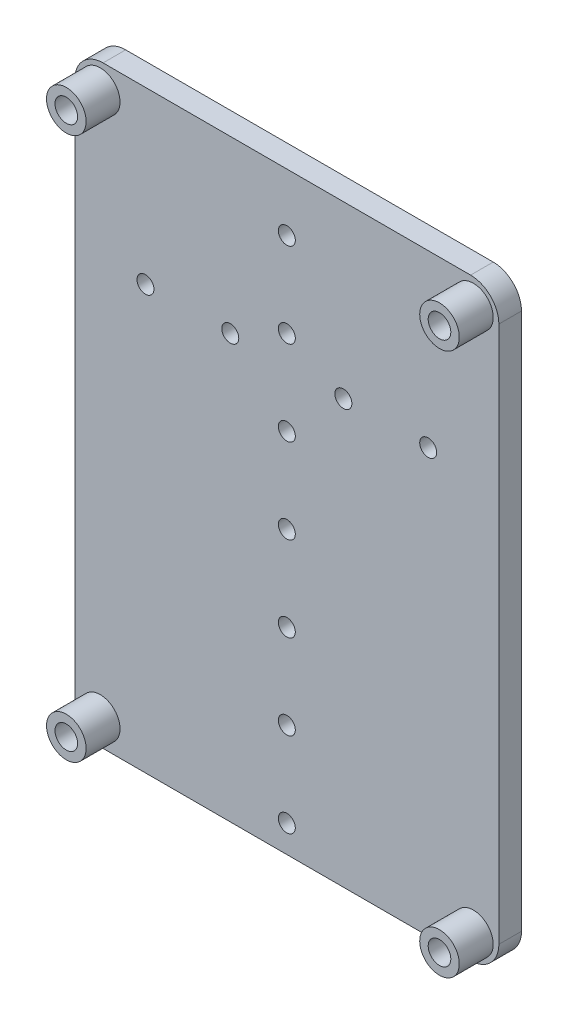
ISO-10303-21;
HEADER;
FILE_DESCRIPTION(('STEP AP214'),'2;1');
FILE_NAME('part.step','',(''),(''),'','','');
FILE_SCHEMA(('AUTOMOTIVE_DESIGN { 1 0 10303 214 1 1 1 1 }'));
ENDSEC;
DATA;
#1=APPLICATION_CONTEXT('core data for automotive mechanical design processes');
#2=APPLICATION_PROTOCOL_DEFINITION('international standard','automotive_design',2000,#1);
#3=PRODUCT_CONTEXT('',#1,'mechanical');
#4=PRODUCT('Part','Part','',(#3));
#5=PRODUCT_RELATED_PRODUCT_CATEGORY('part','',(#4));
#6=PRODUCT_DEFINITION_FORMATION('','',#4);
#7=PRODUCT_DEFINITION_CONTEXT('part definition',#1,'design');
#8=PRODUCT_DEFINITION('design','',#6,#7);
#9=PRODUCT_DEFINITION_SHAPE('','',#8);
#10=(LENGTH_UNIT() NAMED_UNIT(*) SI_UNIT(.MILLI.,.METRE.));
#11=(NAMED_UNIT(*) PLANE_ANGLE_UNIT() SI_UNIT($,.RADIAN.));
#12=(NAMED_UNIT(*) SI_UNIT($,.STERADIAN.) SOLID_ANGLE_UNIT());
#13=UNCERTAINTY_MEASURE_WITH_UNIT(LENGTH_MEASURE(1.E-05),#10,'distance_accuracy_value','');
#14=(GEOMETRIC_REPRESENTATION_CONTEXT(3) GLOBAL_UNCERTAINTY_ASSIGNED_CONTEXT((#13)) GLOBAL_UNIT_ASSIGNED_CONTEXT((#10,
#11,#12)) REPRESENTATION_CONTEXT('',''));
#15=CARTESIAN_POINT('',(0.,0.,0.));
#16=DIRECTION('',(0.,0.,1.));
#17=DIRECTION('',(1.,0.,0.));
#18=AXIS2_PLACEMENT_3D('',#15,#16,#17);
#19=CARTESIAN_POINT('',(101.526557276723,160.311918207768,122.694714262562));
#20=DIRECTION('',(0.,0.,-1.));
#21=DIRECTION('',(-1.,0.,0.));
#22=AXIS2_PLACEMENT_3D('',#19,#20,#21);
#23=CYLINDRICAL_SURFACE('',#22,3.5);
#24=CARTESIAN_POINT('',(101.526557276723,160.311918207768,122.694714262562));
#25=DIRECTION('',(0.,0.,-1.));
#26=DIRECTION('',(-1.,0.,0.));
#27=AXIS2_PLACEMENT_3D('',#24,#25,#26);
#28=CIRCLE('',#27,3.5);
#29=CARTESIAN_POINT('',(98.0265572767228,160.311918207768,122.694714262562));
#30=VERTEX_POINT('',#29);
#31=EDGE_CURVE('E20',#30,#30,#28,.F.);
#32=ORIENTED_EDGE('',*,*,#31,.F.);
#33=EDGE_LOOP('',(#32));
#34=FACE_BOUND('',#33,.T.);
#35=CARTESIAN_POINT('',(101.526557276723,160.311918207768,116.694714262562));
#36=DIRECTION('',(0.,0.,-1.));
#37=DIRECTION('',(-1.,0.,0.));
#38=AXIS2_PLACEMENT_3D('',#35,#36,#37);
#39=CIRCLE('',#38,3.5);
#40=CARTESIAN_POINT('',(98.0265572767228,160.311918207768,116.694714262562));
#41=VERTEX_POINT('',#40);
#42=EDGE_CURVE('E240',#41,#41,#39,.F.);
#43=ORIENTED_EDGE('',*,*,#42,.T.);
#44=EDGE_LOOP('',(#43));
#45=FACE_BOUND('',#44,.T.);
#46=ADVANCED_FACE('F17',(#34,#45),#23,.T.);
#47=CARTESIAN_POINT('',(167.526557276723,64.3119182077676,122.694714262562));
#48=DIRECTION('',(0.,0.,-1.));
#49=DIRECTION('',(-1.,0.,0.));
#50=AXIS2_PLACEMENT_3D('',#47,#48,#49);
#51=CYLINDRICAL_SURFACE('',#50,3.5);
#52=CARTESIAN_POINT('',(167.526557276723,64.3119182077676,122.694714262562));
#53=DIRECTION('',(0.,0.,-1.));
#54=DIRECTION('',(-1.,0.,0.));
#55=AXIS2_PLACEMENT_3D('',#52,#53,#54);
#56=CIRCLE('',#55,3.5);
#57=CARTESIAN_POINT('',(164.026557276723,64.3119182077676,122.694714262562));
#58=VERTEX_POINT('',#57);
#59=EDGE_CURVE('E245',#58,#58,#56,.F.);
#60=ORIENTED_EDGE('',*,*,#59,.F.);
#61=EDGE_LOOP('',(#60));
#62=FACE_BOUND('',#61,.T.);
#63=CARTESIAN_POINT('',(167.526557276723,64.3119182077676,116.694714262562));
#64=DIRECTION('',(0.,0.,-1.));
#65=DIRECTION('',(-1.,0.,0.));
#66=AXIS2_PLACEMENT_3D('',#63,#64,#65);
#67=CIRCLE('',#66,3.5);
#68=CARTESIAN_POINT('',(164.026557276723,64.3119182077676,116.694714262562));
#69=VERTEX_POINT('',#68);
#70=EDGE_CURVE('E234',#69,#69,#67,.F.);
#71=ORIENTED_EDGE('',*,*,#70,.T.);
#72=EDGE_LOOP('',(#71));
#73=FACE_BOUND('',#72,.T.);
#74=ADVANCED_FACE('F256',(#62,#73),#51,.T.);
#75=CARTESIAN_POINT('',(101.526557276723,64.3119182077676,122.694714262562));
#76=DIRECTION('',(0.,0.,-1.));
#77=DIRECTION('',(-1.,0.,0.));
#78=AXIS2_PLACEMENT_3D('',#75,#76,#77);
#79=CYLINDRICAL_SURFACE('',#78,3.5);
#80=CARTESIAN_POINT('',(101.526557276723,64.3119182077676,116.694714262562));
#81=DIRECTION('',(0.,0.,-1.));
#82=DIRECTION('',(-1.,0.,0.));
#83=AXIS2_PLACEMENT_3D('',#80,#81,#82);
#84=CIRCLE('',#83,3.5);
#85=CARTESIAN_POINT('',(98.0265572767228,64.3119182077676,116.694714262562));
#86=VERTEX_POINT('',#85);
#87=EDGE_CURVE('E243',#86,#86,#84,.F.);
#88=ORIENTED_EDGE('',*,*,#87,.T.);
#89=EDGE_LOOP('',(#88));
#90=FACE_BOUND('',#89,.T.);
#91=CARTESIAN_POINT('',(101.526557276723,64.3119182077676,122.694714262562));
#92=DIRECTION('',(0.,0.,-1.));
#93=DIRECTION('',(-1.,0.,0.));
#94=AXIS2_PLACEMENT_3D('',#91,#92,#93);
#95=CIRCLE('',#94,3.5);
#96=CARTESIAN_POINT('',(98.0265572767228,64.3119182077676,122.694714262562));
#97=VERTEX_POINT('',#96);
#98=EDGE_CURVE('E231',#97,#97,#95,.F.);
#99=ORIENTED_EDGE('',*,*,#98,.F.);
#100=EDGE_LOOP('',(#99));
#101=FACE_BOUND('',#100,.T.);
#102=ADVANCED_FACE('F266',(#90,#101),#79,.T.);
#103=CARTESIAN_POINT('',(167.526557276723,160.311918207768,122.694714262562));
#104=DIRECTION('',(0.,0.,-1.));
#105=DIRECTION('',(-1.,0.,0.));
#106=AXIS2_PLACEMENT_3D('',#103,#104,#105);
#107=CYLINDRICAL_SURFACE('',#106,3.5);
#108=CARTESIAN_POINT('',(167.526557276723,160.311918207768,116.694714262562));
#109=DIRECTION('',(0.,0.,-1.));
#110=DIRECTION('',(-1.,0.,0.));
#111=AXIS2_PLACEMENT_3D('',#108,#109,#110);
#112=CIRCLE('',#111,3.5);
#113=CARTESIAN_POINT('',(164.026557276723,160.311918207768,116.694714262562));
#114=VERTEX_POINT('',#113);
#115=EDGE_CURVE('E237',#114,#114,#112,.F.);
#116=ORIENTED_EDGE('',*,*,#115,.T.);
#117=EDGE_LOOP('',(#116));
#118=FACE_BOUND('',#117,.T.);
#119=CARTESIAN_POINT('',(167.526557276723,160.311918207768,122.694714262562));
#120=DIRECTION('',(0.,0.,-1.));
#121=DIRECTION('',(-1.,0.,0.));
#122=AXIS2_PLACEMENT_3D('',#119,#120,#121);
#123=CIRCLE('',#122,3.5);
#124=CARTESIAN_POINT('',(164.026557276723,160.311918207768,122.694714262562));
#125=VERTEX_POINT('',#124);
#126=EDGE_CURVE('E228',#125,#125,#123,.F.);
#127=ORIENTED_EDGE('',*,*,#126,.F.);
#128=EDGE_LOOP('',(#127));
#129=FACE_BOUND('',#128,.T.);
#130=ADVANCED_FACE('F269',(#118,#129),#107,.T.);
#131=CARTESIAN_POINT('',(101.526557276723,160.311918207768,122.694714262562));
#132=DIRECTION('',(0.,0.,1.));
#133=DIRECTION('',(1.,0.,0.));
#134=AXIS2_PLACEMENT_3D('',#131,#132,#133);
#135=PLANE('',#134);
#136=CARTESIAN_POINT('',(101.526557276723,160.311918207768,122.694714262562));
#137=DIRECTION('',(0.,0.,1.));
#138=DIRECTION('',(1.,0.,0.));
#139=AXIS2_PLACEMENT_3D('',#136,#137,#138);
#140=CIRCLE('',#139,2.);
#141=CARTESIAN_POINT('',(103.526557276723,160.311918207768,122.694714262562));
#142=VERTEX_POINT('',#141);
#143=EDGE_CURVE('E225',#142,#142,#140,.F.);
#144=ORIENTED_EDGE('',*,*,#143,.T.);
#145=EDGE_LOOP('',(#144));
#146=FACE_BOUND('',#145,.T.);
#147=ORIENTED_EDGE('',*,*,#31,.T.);
#148=EDGE_LOOP('',(#147));
#149=FACE_BOUND('',#148,.T.);
#150=ADVANCED_FACE('F252',(#146,#149),#135,.T.);
#151=CARTESIAN_POINT('',(167.526557276723,64.3119182077676,122.694714262562));
#152=DIRECTION('',(0.,0.,1.));
#153=DIRECTION('',(1.,0.,0.));
#154=AXIS2_PLACEMENT_3D('',#151,#152,#153);
#155=PLANE('',#154);
#156=CARTESIAN_POINT('',(167.526557276723,64.3119182077676,122.694714262562));
#157=DIRECTION('',(0.,0.,1.));
#158=DIRECTION('',(1.,0.,0.));
#159=AXIS2_PLACEMENT_3D('',#156,#157,#158);
#160=CIRCLE('',#159,2.);
#161=CARTESIAN_POINT('',(169.526557276723,64.3119182077676,122.694714262562));
#162=VERTEX_POINT('',#161);
#163=EDGE_CURVE('E222',#162,#162,#160,.F.);
#164=ORIENTED_EDGE('',*,*,#163,.T.);
#165=EDGE_LOOP('',(#164));
#166=FACE_BOUND('',#165,.T.);
#167=ORIENTED_EDGE('',*,*,#59,.T.);
#168=EDGE_LOOP('',(#167));
#169=FACE_BOUND('',#168,.T.);
#170=ADVANCED_FACE('F261',(#166,#169),#155,.T.);
#171=CARTESIAN_POINT('',(0.,0.,116.694714262562));
#172=DIRECTION('',(0.,0.,-1.));
#173=DIRECTION('',(-1.,0.,0.));
#174=AXIS2_PLACEMENT_3D('',#171,#172,#173);
#175=PLANE('',#174);
#176=ORIENTED_EDGE('',*,*,#70,.F.);
#177=EDGE_LOOP('',(#176));
#178=FACE_BOUND('',#177,.T.);
#179=ORIENTED_EDGE('',*,*,#115,.F.);
#180=EDGE_LOOP('',(#179));
#181=FACE_BOUND('',#180,.T.);
#182=CARTESIAN_POINT('',(134.526557276723,64.6370852747385,116.694714262562));
#183=DIRECTION('',(0.,0.,1.));
#184=DIRECTION('',(1.,0.,0.));
#185=AXIS2_PLACEMENT_3D('',#182,#183,#184);
#186=CIRCLE('',#185,1.5);
#187=CARTESIAN_POINT('',(136.026557276723,64.6370852747385,116.694714262562));
#188=VERTEX_POINT('',#187);
#189=EDGE_CURVE('E183',#188,#188,#186,.F.);
#190=ORIENTED_EDGE('',*,*,#189,.T.);
#191=EDGE_LOOP('',(#190));
#192=FACE_BOUND('',#191,.T.);
#193=CARTESIAN_POINT('',(134.526557276723,79.6370852747385,116.694714262562));
#194=DIRECTION('',(0.,0.,1.));
#195=DIRECTION('',(1.,0.,0.));
#196=AXIS2_PLACEMENT_3D('',#193,#194,#195);
#197=CIRCLE('',#196,1.5);
#198=CARTESIAN_POINT('',(136.026557276723,79.6370852747385,116.694714262562));
#199=VERTEX_POINT('',#198);
#200=EDGE_CURVE('E219',#199,#199,#197,.F.);
#201=ORIENTED_EDGE('',*,*,#200,.T.);
#202=EDGE_LOOP('',(#201));
#203=FACE_BOUND('',#202,.T.);
#204=CARTESIAN_POINT('',(134.526557276723,94.6370852747384,116.694714262562));
#205=DIRECTION('',(0.,0.,1.));
#206=DIRECTION('',(1.,0.,0.));
#207=AXIS2_PLACEMENT_3D('',#204,#205,#206);
#208=CIRCLE('',#207,1.5);
#209=CARTESIAN_POINT('',(136.026557276723,94.6370852747384,116.694714262562));
#210=VERTEX_POINT('',#209);
#211=EDGE_CURVE('E186',#210,#210,#208,.F.);
#212=ORIENTED_EDGE('',*,*,#211,.T.);
#213=EDGE_LOOP('',(#212));
#214=FACE_BOUND('',#213,.T.);
#215=CARTESIAN_POINT('',(134.526557276723,109.637085274738,116.694714262562));
#216=DIRECTION('',(0.,0.,1.));
#217=DIRECTION('',(1.,0.,0.));
#218=AXIS2_PLACEMENT_3D('',#215,#216,#217);
#219=CIRCLE('',#218,1.5);
#220=CARTESIAN_POINT('',(136.026557276723,109.637085274738,116.694714262562));
#221=VERTEX_POINT('',#220);
#222=EDGE_CURVE('E216',#221,#221,#219,.F.);
#223=ORIENTED_EDGE('',*,*,#222,.T.);
#224=EDGE_LOOP('',(#223));
#225=FACE_BOUND('',#224,.T.);
#226=CARTESIAN_POINT('',(134.526557276723,124.637085274738,116.694714262562));
#227=DIRECTION('',(0.,0.,1.));
#228=DIRECTION('',(1.,0.,0.));
#229=AXIS2_PLACEMENT_3D('',#226,#227,#228);
#230=CIRCLE('',#229,1.5);
#231=CARTESIAN_POINT('',(136.026557276723,124.637085274738,116.694714262562));
#232=VERTEX_POINT('',#231);
#233=EDGE_CURVE('E189',#232,#232,#230,.F.);
#234=ORIENTED_EDGE('',*,*,#233,.T.);
#235=EDGE_LOOP('',(#234));
#236=FACE_BOUND('',#235,.T.);
#237=CARTESIAN_POINT('',(109.526557276723,134.637085274738,116.694714262562));
#238=DIRECTION('',(0.,0.,1.));
#239=DIRECTION('',(1.,0.,0.));
#240=AXIS2_PLACEMENT_3D('',#237,#238,#239);
#241=CIRCLE('',#240,1.5);
#242=CARTESIAN_POINT('',(111.026557276723,134.637085274738,116.694714262562));
#243=VERTEX_POINT('',#242);
#244=EDGE_CURVE('E213',#243,#243,#241,.F.);
#245=ORIENTED_EDGE('',*,*,#244,.T.);
#246=EDGE_LOOP('',(#245));
#247=FACE_BOUND('',#246,.T.);
#248=CARTESIAN_POINT('',(124.526557276723,134.637085274738,116.694714262562));
#249=DIRECTION('',(0.,0.,1.));
#250=DIRECTION('',(1.,0.,0.));
#251=AXIS2_PLACEMENT_3D('',#248,#249,#250);
#252=CIRCLE('',#251,1.50000000000002);
#253=CARTESIAN_POINT('',(126.026557276723,134.637085274738,116.694714262562));
#254=VERTEX_POINT('',#253);
#255=EDGE_CURVE('E192',#254,#254,#252,.F.);
#256=ORIENTED_EDGE('',*,*,#255,.T.);
#257=EDGE_LOOP('',(#256));
#258=FACE_BOUND('',#257,.T.);
#259=CARTESIAN_POINT('',(159.526557276723,134.637085274738,116.694714262562));
#260=DIRECTION('',(0.,0.,1.));
#261=DIRECTION('',(1.,0.,0.));
#262=AXIS2_PLACEMENT_3D('',#259,#260,#261);
#263=CIRCLE('',#262,1.5);
#264=CARTESIAN_POINT('',(161.026557276723,134.637085274738,116.694714262562));
#265=VERTEX_POINT('',#264);
#266=EDGE_CURVE('E210',#265,#265,#263,.F.);
#267=ORIENTED_EDGE('',*,*,#266,.T.);
#268=EDGE_LOOP('',(#267));
#269=FACE_BOUND('',#268,.T.);
#270=CARTESIAN_POINT('',(144.526557276723,134.637085274738,116.694714262562));
#271=DIRECTION('',(0.,0.,1.));
#272=DIRECTION('',(1.,0.,0.));
#273=AXIS2_PLACEMENT_3D('',#270,#271,#272);
#274=CIRCLE('',#273,1.50000000000003);
#275=CARTESIAN_POINT('',(146.026557276723,134.637085274738,116.694714262562));
#276=VERTEX_POINT('',#275);
#277=EDGE_CURVE('E195',#276,#276,#274,.F.);
#278=ORIENTED_EDGE('',*,*,#277,.T.);
#279=EDGE_LOOP('',(#278));
#280=FACE_BOUND('',#279,.T.);
#281=CARTESIAN_POINT('',(134.526557276723,139.637085274738,116.694714262562));
#282=DIRECTION('',(0.,0.,1.));
#283=DIRECTION('',(1.,0.,0.));
#284=AXIS2_PLACEMENT_3D('',#281,#282,#283);
#285=CIRCLE('',#284,1.5);
#286=CARTESIAN_POINT('',(136.026557276723,139.637085274738,116.694714262562));
#287=VERTEX_POINT('',#286);
#288=EDGE_CURVE('E113',#287,#287,#285,.F.);
#289=ORIENTED_EDGE('',*,*,#288,.T.);
#290=EDGE_LOOP('',(#289));
#291=FACE_BOUND('',#290,.T.);
#292=CARTESIAN_POINT('',(134.526557276723,154.637085274738,116.694714262562));
#293=DIRECTION('',(0.,0.,1.));
#294=DIRECTION('',(1.,0.,0.));
#295=AXIS2_PLACEMENT_3D('',#292,#293,#294);
#296=CIRCLE('',#295,1.5);
#297=CARTESIAN_POINT('',(136.026557276723,154.637085274738,116.694714262562));
#298=VERTEX_POINT('',#297);
#299=EDGE_CURVE('E198',#298,#298,#296,.F.);
#300=ORIENTED_EDGE('',*,*,#299,.T.);
#301=EDGE_LOOP('',(#300));
#302=FACE_BOUND('',#301,.T.);
#303=CARTESIAN_POINT('',(102.026557276723,64.8119182077676,116.694714262562));
#304=DIRECTION('',(0.,0.,1.));
#305=DIRECTION('',(1.,0.,0.));
#306=AXIS2_PLACEMENT_3D('',#303,#304,#305);
#307=CIRCLE('',#306,5.);
#308=CARTESIAN_POINT('',(102.026557276723,59.8119182077676,116.694714262562));
#309=VERTEX_POINT('',#308);
#310=CARTESIAN_POINT('',(97.0265572767228,64.8119182077676,116.694714262562));
#311=VERTEX_POINT('',#310);
#312=EDGE_CURVE('E87',#309,#311,#307,.F.);
#313=ORIENTED_EDGE('',*,*,#312,.F.);
#314=DIRECTION('',(1.,0.,0.));
#315=VECTOR('',#314,1.);
#316=CARTESIAN_POINT('',(172.026557276723,59.8119182077676,116.694714262562));
#317=LINE('',#316,#315);
#318=CARTESIAN_POINT('',(167.026557276723,59.8119182077676,116.694714262562));
#319=VERTEX_POINT('',#318);
#320=EDGE_CURVE('E78',#309,#319,#317,.T.);
#321=ORIENTED_EDGE('',*,*,#320,.T.);
#322=CARTESIAN_POINT('',(167.026557276723,64.8119182077676,116.694714262562));
#323=DIRECTION('',(0.,0.,1.));
#324=DIRECTION('',(1.,0.,0.));
#325=AXIS2_PLACEMENT_3D('',#322,#323,#324);
#326=CIRCLE('',#325,5.);
#327=CARTESIAN_POINT('',(172.026557276723,64.8119182077676,116.694714262562));
#328=VERTEX_POINT('',#327);
#329=EDGE_CURVE('E202',#328,#319,#326,.F.);
#330=ORIENTED_EDGE('',*,*,#329,.F.);
#331=DIRECTION('',(0.,1.,0.));
#332=VECTOR('',#331,1.);
#333=CARTESIAN_POINT('',(172.026557276723,164.811918207768,116.694714262562));
#334=LINE('',#333,#332);
#335=CARTESIAN_POINT('',(172.026557276723,159.811918207768,116.694714262562));
#336=VERTEX_POINT('',#335);
#337=EDGE_CURVE('E114',#328,#336,#334,.T.);
#338=ORIENTED_EDGE('',*,*,#337,.T.);
#339=CARTESIAN_POINT('',(167.026557276723,159.811918207768,116.694714262562));
#340=DIRECTION('',(0.,0.,1.));
#341=DIRECTION('',(1.,0.,0.));
#342=AXIS2_PLACEMENT_3D('',#339,#340,#341);
#343=CIRCLE('',#342,5.);
#344=CARTESIAN_POINT('',(167.026557276723,164.811918207768,116.694714262562));
#345=VERTEX_POINT('',#344);
#346=EDGE_CURVE('E205',#345,#336,#343,.F.);
#347=ORIENTED_EDGE('',*,*,#346,.F.);
#348=DIRECTION('',(1.,0.,0.));
#349=VECTOR('',#348,1.);
#350=CARTESIAN_POINT('',(172.026557276723,164.811918207768,116.694714262562));
#351=LINE('',#350,#349);
#352=CARTESIAN_POINT('',(102.026557276723,164.811918207768,116.694714262562));
#353=VERTEX_POINT('',#352);
#354=EDGE_CURVE('E118',#345,#353,#351,.F.);
#355=ORIENTED_EDGE('',*,*,#354,.T.);
#356=CARTESIAN_POINT('',(102.026557276723,159.811918207768,116.694714262562));
#357=DIRECTION('',(0.,0.,1.));
#358=DIRECTION('',(1.,0.,0.));
#359=AXIS2_PLACEMENT_3D('',#356,#357,#358);
#360=CIRCLE('',#359,5.);
#361=CARTESIAN_POINT('',(97.0265572767228,159.811918207768,116.694714262562));
#362=VERTEX_POINT('',#361);
#363=EDGE_CURVE('E90',#362,#353,#360,.F.);
#364=ORIENTED_EDGE('',*,*,#363,.F.);
#365=DIRECTION('',(0.,1.,0.));
#366=VECTOR('',#365,1.);
#367=CARTESIAN_POINT('',(97.0265572767228,164.811918207768,116.694714262562));
#368=LINE('',#367,#366);
#369=EDGE_CURVE('E83',#362,#311,#368,.F.);
#370=ORIENTED_EDGE('',*,*,#369,.T.);
#371=EDGE_LOOP('',(#313,#321,#330,#338,#347,#355,#364,#370));
#372=FACE_BOUND('',#371,.T.);
#373=ORIENTED_EDGE('',*,*,#42,.F.);
#374=EDGE_LOOP('',(#373));
#375=FACE_BOUND('',#374,.T.);
#376=ORIENTED_EDGE('',*,*,#87,.F.);
#377=EDGE_LOOP('',(#376));
#378=FACE_BOUND('',#377,.T.);
#379=ADVANCED_FACE('F85',(#178,#181,#192,#203,#214,#225,#236,#247,#258,#269,#280,#291,#302,#372,
#375,#378),#175,.F.);
#380=CARTESIAN_POINT('',(101.526557276723,64.3119182077676,122.694714262562));
#381=DIRECTION('',(0.,0.,1.));
#382=DIRECTION('',(1.,0.,0.));
#383=AXIS2_PLACEMENT_3D('',#380,#381,#382);
#384=PLANE('',#383);
#385=CARTESIAN_POINT('',(101.526557276723,64.3119182077676,122.694714262562));
#386=DIRECTION('',(0.,0.,1.));
#387=DIRECTION('',(1.,0.,0.));
#388=AXIS2_PLACEMENT_3D('',#385,#386,#387);
#389=CIRCLE('',#388,2.);
#390=CARTESIAN_POINT('',(103.526557276723,64.3119182077676,122.694714262562));
#391=VERTEX_POINT('',#390);
#392=EDGE_CURVE('E180',#391,#391,#389,.F.);
#393=ORIENTED_EDGE('',*,*,#392,.T.);
#394=EDGE_LOOP('',(#393));
#395=FACE_BOUND('',#394,.T.);
#396=ORIENTED_EDGE('',*,*,#98,.T.);
#397=EDGE_LOOP('',(#396));
#398=FACE_BOUND('',#397,.T.);
#399=ADVANCED_FACE('F260',(#395,#398),#384,.T.);
#400=CARTESIAN_POINT('',(167.526557276723,160.311918207768,122.694714262562));
#401=DIRECTION('',(0.,0.,1.));
#402=DIRECTION('',(1.,0.,0.));
#403=AXIS2_PLACEMENT_3D('',#400,#401,#402);
#404=PLANE('',#403);
#405=CARTESIAN_POINT('',(167.526557276723,160.311918207768,122.694714262562));
#406=DIRECTION('',(0.,0.,1.));
#407=DIRECTION('',(1.,0.,0.));
#408=AXIS2_PLACEMENT_3D('',#405,#406,#407);
#409=CIRCLE('',#408,2.);
#410=CARTESIAN_POINT('',(169.526557276723,160.311918207768,122.694714262562));
#411=VERTEX_POINT('',#410);
#412=EDGE_CURVE('E177',#411,#411,#409,.F.);
#413=ORIENTED_EDGE('',*,*,#412,.T.);
#414=EDGE_LOOP('',(#413));
#415=FACE_BOUND('',#414,.T.);
#416=ORIENTED_EDGE('',*,*,#126,.T.);
#417=EDGE_LOOP('',(#416));
#418=FACE_BOUND('',#417,.T.);
#419=ADVANCED_FACE('F274',(#415,#418),#404,.T.);
#420=CARTESIAN_POINT('',(101.526557276723,160.311918207768,112.694714262562));
#421=DIRECTION('',(0.,0.,1.));
#422=DIRECTION('',(1.,0.,0.));
#423=AXIS2_PLACEMENT_3D('',#420,#421,#422);
#424=CYLINDRICAL_SURFACE('',#423,2.);
#425=CARTESIAN_POINT('',(101.526557276723,160.311918207768,112.694714262562));
#426=DIRECTION('',(0.,0.,1.));
#427=DIRECTION('',(1.,0.,0.));
#428=AXIS2_PLACEMENT_3D('',#425,#426,#427);
#429=CIRCLE('',#428,2.);
#430=CARTESIAN_POINT('',(103.526557276723,160.311918207768,112.694714262562));
#431=VERTEX_POINT('',#430);
#432=EDGE_CURVE('E174',#431,#431,#429,.T.);
#433=ORIENTED_EDGE('',*,*,#432,.F.);
#434=EDGE_LOOP('',(#433));
#435=FACE_BOUND('',#434,.T.);
#436=ORIENTED_EDGE('',*,*,#143,.F.);
#437=EDGE_LOOP('',(#436));
#438=FACE_BOUND('',#437,.T.);
#439=ADVANCED_FACE('F281',(#435,#438),#424,.F.);
#440=CARTESIAN_POINT('',(167.526557276723,64.3119182077676,112.694714262562));
#441=DIRECTION('',(0.,0.,1.));
#442=DIRECTION('',(1.,0.,0.));
#443=AXIS2_PLACEMENT_3D('',#440,#441,#442);
#444=CYLINDRICAL_SURFACE('',#443,2.);
#445=CARTESIAN_POINT('',(167.526557276723,64.3119182077676,112.694714262562));
#446=DIRECTION('',(0.,0.,1.));
#447=DIRECTION('',(1.,0.,0.));
#448=AXIS2_PLACEMENT_3D('',#445,#446,#447);
#449=CIRCLE('',#448,2.);
#450=CARTESIAN_POINT('',(169.526557276723,64.3119182077676,112.694714262562));
#451=VERTEX_POINT('',#450);
#452=EDGE_CURVE('E171',#451,#451,#449,.T.);
#453=ORIENTED_EDGE('',*,*,#452,.F.);
#454=EDGE_LOOP('',(#453));
#455=FACE_BOUND('',#454,.T.);
#456=ORIENTED_EDGE('',*,*,#163,.F.);
#457=EDGE_LOOP('',(#456));
#458=FACE_BOUND('',#457,.T.);
#459=ADVANCED_FACE('F369',(#455,#458),#444,.F.);
#460=CARTESIAN_POINT('',(134.526557276723,79.6370852747385,112.694714262562));
#461=DIRECTION('',(0.,0.,1.));
#462=DIRECTION('',(1.,0.,0.));
#463=AXIS2_PLACEMENT_3D('',#460,#461,#462);
#464=CYLINDRICAL_SURFACE('',#463,1.5);
#465=CARTESIAN_POINT('',(134.526557276723,79.6370852747385,112.694714262562));
#466=DIRECTION('',(0.,0.,1.));
#467=DIRECTION('',(1.,0.,0.));
#468=AXIS2_PLACEMENT_3D('',#465,#466,#467);
#469=CIRCLE('',#468,1.5);
#470=CARTESIAN_POINT('',(136.026557276723,79.6370852747385,112.694714262562));
#471=VERTEX_POINT('',#470);
#472=EDGE_CURVE('E168',#471,#471,#469,.T.);
#473=ORIENTED_EDGE('',*,*,#472,.F.);
#474=EDGE_LOOP('',(#473));
#475=FACE_BOUND('',#474,.T.);
#476=ORIENTED_EDGE('',*,*,#200,.F.);
#477=EDGE_LOOP('',(#476));
#478=FACE_BOUND('',#477,.T.);
#479=ADVANCED_FACE('F365',(#475,#478),#464,.F.);
#480=CARTESIAN_POINT('',(134.526557276723,109.637085274738,112.694714262562));
#481=DIRECTION('',(0.,0.,1.));
#482=DIRECTION('',(1.,0.,0.));
#483=AXIS2_PLACEMENT_3D('',#480,#481,#482);
#484=CYLINDRICAL_SURFACE('',#483,1.5);
#485=CARTESIAN_POINT('',(134.526557276723,109.637085274738,112.694714262562));
#486=DIRECTION('',(0.,0.,1.));
#487=DIRECTION('',(1.,0.,0.));
#488=AXIS2_PLACEMENT_3D('',#485,#486,#487);
#489=CIRCLE('',#488,1.5);
#490=CARTESIAN_POINT('',(136.026557276723,109.637085274738,112.694714262562));
#491=VERTEX_POINT('',#490);
#492=EDGE_CURVE('E165',#491,#491,#489,.T.);
#493=ORIENTED_EDGE('',*,*,#492,.F.);
#494=EDGE_LOOP('',(#493));
#495=FACE_BOUND('',#494,.T.);
#496=ORIENTED_EDGE('',*,*,#222,.F.);
#497=EDGE_LOOP('',(#496));
#498=FACE_BOUND('',#497,.T.);
#499=ADVANCED_FACE('F361',(#495,#498),#484,.F.);
#500=CARTESIAN_POINT('',(109.526557276723,134.637085274738,112.694714262562));
#501=DIRECTION('',(0.,0.,1.));
#502=DIRECTION('',(1.,0.,0.));
#503=AXIS2_PLACEMENT_3D('',#500,#501,#502);
#504=CYLINDRICAL_SURFACE('',#503,1.5);
#505=CARTESIAN_POINT('',(109.526557276723,134.637085274738,112.694714262562));
#506=DIRECTION('',(0.,0.,1.));
#507=DIRECTION('',(1.,0.,0.));
#508=AXIS2_PLACEMENT_3D('',#505,#506,#507);
#509=CIRCLE('',#508,1.5);
#510=CARTESIAN_POINT('',(111.026557276723,134.637085274738,112.694714262562));
#511=VERTEX_POINT('',#510);
#512=EDGE_CURVE('E162',#511,#511,#509,.T.);
#513=ORIENTED_EDGE('',*,*,#512,.F.);
#514=EDGE_LOOP('',(#513));
#515=FACE_BOUND('',#514,.T.);
#516=ORIENTED_EDGE('',*,*,#244,.F.);
#517=EDGE_LOOP('',(#516));
#518=FACE_BOUND('',#517,.T.);
#519=ADVANCED_FACE('F357',(#515,#518),#504,.F.);
#520=CARTESIAN_POINT('',(159.526557276723,134.637085274738,112.694714262562));
#521=DIRECTION('',(0.,0.,1.));
#522=DIRECTION('',(1.,0.,0.));
#523=AXIS2_PLACEMENT_3D('',#520,#521,#522);
#524=CYLINDRICAL_SURFACE('',#523,1.5);
#525=CARTESIAN_POINT('',(159.526557276723,134.637085274738,112.694714262562));
#526=DIRECTION('',(0.,0.,1.));
#527=DIRECTION('',(1.,0.,0.));
#528=AXIS2_PLACEMENT_3D('',#525,#526,#527);
#529=CIRCLE('',#528,1.5);
#530=CARTESIAN_POINT('',(161.026557276723,134.637085274738,112.694714262562));
#531=VERTEX_POINT('',#530);
#532=EDGE_CURVE('E159',#531,#531,#529,.T.);
#533=ORIENTED_EDGE('',*,*,#532,.F.);
#534=EDGE_LOOP('',(#533));
#535=FACE_BOUND('',#534,.T.);
#536=ORIENTED_EDGE('',*,*,#266,.F.);
#537=EDGE_LOOP('',(#536));
#538=FACE_BOUND('',#537,.T.);
#539=ADVANCED_FACE('F353',(#535,#538),#524,.F.);
#540=CARTESIAN_POINT('',(134.526557276723,139.637085274738,112.694714262562));
#541=DIRECTION('',(0.,0.,1.));
#542=DIRECTION('',(1.,0.,0.));
#543=AXIS2_PLACEMENT_3D('',#540,#541,#542);
#544=CYLINDRICAL_SURFACE('',#543,1.5);
#545=CARTESIAN_POINT('',(134.526557276723,139.637085274738,112.694714262562));
#546=DIRECTION('',(0.,0.,1.));
#547=DIRECTION('',(1.,0.,0.));
#548=AXIS2_PLACEMENT_3D('',#545,#546,#547);
#549=CIRCLE('',#548,1.5);
#550=CARTESIAN_POINT('',(136.026557276723,139.637085274738,112.694714262562));
#551=VERTEX_POINT('',#550);
#552=EDGE_CURVE('E156',#551,#551,#549,.T.);
#553=ORIENTED_EDGE('',*,*,#552,.F.);
#554=EDGE_LOOP('',(#553));
#555=FACE_BOUND('',#554,.T.);
#556=ORIENTED_EDGE('',*,*,#288,.F.);
#557=EDGE_LOOP('',(#556));
#558=FACE_BOUND('',#557,.T.);
#559=ADVANCED_FACE('F350',(#555,#558),#544,.F.);
#560=CARTESIAN_POINT('',(172.026557276723,59.8119182077676,112.694714262562));
#561=DIRECTION('',(0.,1.,0.));
#562=DIRECTION('',(0.,0.,1.));
#563=AXIS2_PLACEMENT_3D('',#560,#561,#562);
#564=PLANE('',#563);
#565=DIRECTION('',(0.,0.,1.));
#566=VECTOR('',#565,1.);
#567=CARTESIAN_POINT('',(102.026557276723,59.8119182077676,112.694714262562));
#568=LINE('',#567,#566);
#569=CARTESIAN_POINT('',(102.026557276723,59.8119182077676,112.694714262562));
#570=VERTEX_POINT('',#569);
#571=EDGE_CURVE('E100',#570,#309,#568,.T.);
#572=ORIENTED_EDGE('',*,*,#571,.F.);
#573=DIRECTION('',(-1.,0.,0.));
#574=VECTOR('',#573,1.);
#575=CARTESIAN_POINT('',(0.,59.8119182077676,112.694714262562));
#576=LINE('',#575,#574);
#577=CARTESIAN_POINT('',(167.026557276723,59.8119182077676,112.694714262562));
#578=VERTEX_POINT('',#577);
#579=EDGE_CURVE('E155',#578,#570,#576,.T.);
#580=ORIENTED_EDGE('',*,*,#579,.F.);
#581=DIRECTION('',(0.,0.,1.));
#582=VECTOR('',#581,1.);
#583=CARTESIAN_POINT('',(167.026557276723,59.8119182077676,112.694714262562));
#584=LINE('',#583,#582);
#585=EDGE_CURVE('E201',#319,#578,#584,.F.);
#586=ORIENTED_EDGE('',*,*,#585,.F.);
#587=ORIENTED_EDGE('',*,*,#320,.F.);
#588=EDGE_LOOP('',(#572,#580,#586,#587));
#589=FACE_BOUND('',#588,.T.);
#590=ADVANCED_FACE('F347',(#589),#564,.F.);
#591=CARTESIAN_POINT('',(102.026557276723,64.8119182077676,112.694714262562));
#592=DIRECTION('',(0.,0.,1.));
#593=DIRECTION('',(1.,0.,0.));
#594=AXIS2_PLACEMENT_3D('',#591,#592,#593);
#595=CYLINDRICAL_SURFACE('',#594,5.);
#596=ORIENTED_EDGE('',*,*,#312,.T.);
#597=DIRECTION('',(0.,0.,-1.));
#598=VECTOR('',#597,1.);
#599=CARTESIAN_POINT('',(97.0265572767228,64.8119182077676,112.694714262562));
#600=LINE('',#599,#598);
#601=CARTESIAN_POINT('',(97.0265572767228,64.8119182077676,112.694714262562));
#602=VERTEX_POINT('',#601);
#603=EDGE_CURVE('E94',#311,#602,#600,.T.);
#604=ORIENTED_EDGE('',*,*,#603,.T.);
#605=CARTESIAN_POINT('',(102.026557276723,64.8119182077676,112.694714262562));
#606=DIRECTION('',(0.,0.,1.));
#607=DIRECTION('',(1.,0.,0.));
#608=AXIS2_PLACEMENT_3D('',#605,#606,#607);
#609=CIRCLE('',#608,5.);
#610=EDGE_CURVE('E153',#570,#602,#609,.F.);
#611=ORIENTED_EDGE('',*,*,#610,.F.);
#612=ORIENTED_EDGE('',*,*,#571,.T.);
#613=EDGE_LOOP('',(#596,#604,#611,#612));
#614=FACE_BOUND('',#613,.T.);
#615=ADVANCED_FACE('F97',(#614),#595,.T.);
#616=CARTESIAN_POINT('',(97.0265572767228,164.811918207768,112.694714262562));
#617=DIRECTION('',(1.,0.,0.));
#618=DIRECTION('',(0.,0.,-1.));
#619=AXIS2_PLACEMENT_3D('',#616,#617,#618);
#620=PLANE('',#619);
#621=ORIENTED_EDGE('',*,*,#603,.F.);
#622=ORIENTED_EDGE('',*,*,#369,.F.);
#623=DIRECTION('',(0.,0.,1.));
#624=VECTOR('',#623,1.);
#625=CARTESIAN_POINT('',(97.0265572767228,159.811918207768,112.694714262562));
#626=LINE('',#625,#624);
#627=CARTESIAN_POINT('',(97.0265572767228,159.811918207768,112.694714262562));
#628=VERTEX_POINT('',#627);
#629=EDGE_CURVE('E106',#628,#362,#626,.T.);
#630=ORIENTED_EDGE('',*,*,#629,.F.);
#631=DIRECTION('',(0.,1.,0.));
#632=VECTOR('',#631,1.);
#633=CARTESIAN_POINT('',(97.0265572767228,0.,112.694714262562));
#634=LINE('',#633,#632);
#635=EDGE_CURVE('E104',#602,#628,#634,.T.);
#636=ORIENTED_EDGE('',*,*,#635,.F.);
#637=EDGE_LOOP('',(#621,#622,#630,#636));
#638=FACE_BOUND('',#637,.T.);
#639=ADVANCED_FACE('F102',(#638),#620,.F.);
#640=CARTESIAN_POINT('',(102.026557276723,159.811918207768,112.694714262562));
#641=DIRECTION('',(0.,0.,1.));
#642=DIRECTION('',(1.,0.,0.));
#643=AXIS2_PLACEMENT_3D('',#640,#641,#642);
#644=CYLINDRICAL_SURFACE('',#643,5.);
#645=ORIENTED_EDGE('',*,*,#363,.T.);
#646=DIRECTION('',(0.,0.,-1.));
#647=VECTOR('',#646,1.);
#648=CARTESIAN_POINT('',(102.026557276723,164.811918207768,112.694714262562));
#649=LINE('',#648,#647);
#650=CARTESIAN_POINT('',(102.026557276723,164.811918207768,112.694714262562));
#651=VERTEX_POINT('',#650);
#652=EDGE_CURVE('E120',#353,#651,#649,.T.);
#653=ORIENTED_EDGE('',*,*,#652,.T.);
#654=CARTESIAN_POINT('',(102.026557276723,159.811918207768,112.694714262562));
#655=DIRECTION('',(0.,0.,1.));
#656=DIRECTION('',(1.,0.,0.));
#657=AXIS2_PLACEMENT_3D('',#654,#655,#656);
#658=CIRCLE('',#657,5.);
#659=EDGE_CURVE('E150',#628,#651,#658,.F.);
#660=ORIENTED_EDGE('',*,*,#659,.F.);
#661=ORIENTED_EDGE('',*,*,#629,.T.);
#662=EDGE_LOOP('',(#645,#653,#660,#661));
#663=FACE_BOUND('',#662,.T.);
#664=ADVANCED_FACE('F338',(#663),#644,.T.);
#665=CARTESIAN_POINT('',(172.026557276723,164.811918207768,112.694714262562));
#666=DIRECTION('',(0.,-1.,0.));
#667=DIRECTION('',(0.,0.,-1.));
#668=AXIS2_PLACEMENT_3D('',#665,#666,#667);
#669=PLANE('',#668);
#670=DIRECTION('',(0.,0.,1.));
#671=VECTOR('',#670,1.);
#672=CARTESIAN_POINT('',(167.026557276723,164.811918207768,112.694714262562));
#673=LINE('',#672,#671);
#674=CARTESIAN_POINT('',(167.026557276723,164.811918207768,112.694714262562));
#675=VERTEX_POINT('',#674);
#676=EDGE_CURVE('E119',#675,#345,#673,.T.);
#677=ORIENTED_EDGE('',*,*,#676,.F.);
#678=DIRECTION('',(-1.,0.,0.));
#679=VECTOR('',#678,1.);
#680=CARTESIAN_POINT('',(0.,164.811918207768,112.694714262562));
#681=LINE('',#680,#679);
#682=EDGE_CURVE('E149',#651,#675,#681,.F.);
#683=ORIENTED_EDGE('',*,*,#682,.F.);
#684=ORIENTED_EDGE('',*,*,#652,.F.);
#685=ORIENTED_EDGE('',*,*,#354,.F.);
#686=EDGE_LOOP('',(#677,#683,#684,#685));
#687=FACE_BOUND('',#686,.T.);
#688=ADVANCED_FACE('F334',(#687),#669,.F.);
#689=CARTESIAN_POINT('',(167.026557276723,159.811918207768,112.694714262562));
#690=DIRECTION('',(0.,0.,1.));
#691=DIRECTION('',(1.,0.,0.));
#692=AXIS2_PLACEMENT_3D('',#689,#690,#691);
#693=CYLINDRICAL_SURFACE('',#692,5.);
#694=ORIENTED_EDGE('',*,*,#346,.T.);
#695=DIRECTION('',(0.,0.,1.));
#696=VECTOR('',#695,1.);
#697=CARTESIAN_POINT('',(172.026557276723,159.811918207768,112.694714262562));
#698=LINE('',#697,#696);
#699=CARTESIAN_POINT('',(172.026557276723,159.811918207768,112.694714262562));
#700=VERTEX_POINT('',#699);
#701=EDGE_CURVE('E117',#336,#700,#698,.F.);
#702=ORIENTED_EDGE('',*,*,#701,.T.);
#703=CARTESIAN_POINT('',(167.026557276723,159.811918207768,112.694714262562));
#704=DIRECTION('',(0.,0.,1.));
#705=DIRECTION('',(1.,0.,0.));
#706=AXIS2_PLACEMENT_3D('',#703,#704,#705);
#707=CIRCLE('',#706,5.);
#708=EDGE_CURVE('E146',#675,#700,#707,.F.);
#709=ORIENTED_EDGE('',*,*,#708,.F.);
#710=ORIENTED_EDGE('',*,*,#676,.T.);
#711=EDGE_LOOP('',(#694,#702,#709,#710));
#712=FACE_BOUND('',#711,.T.);
#713=ADVANCED_FACE('F331',(#712),#693,.T.);
#714=CARTESIAN_POINT('',(172.026557276723,164.811918207768,112.694714262562));
#715=DIRECTION('',(-1.,0.,0.));
#716=DIRECTION('',(0.,0.,1.));
#717=AXIS2_PLACEMENT_3D('',#714,#715,#716);
#718=PLANE('',#717);
#719=DIRECTION('',(0.,0.,1.));
#720=VECTOR('',#719,1.);
#721=CARTESIAN_POINT('',(172.026557276723,64.8119182077676,112.694714262562));
#722=LINE('',#721,#720);
#723=CARTESIAN_POINT('',(172.026557276723,64.8119182077676,112.694714262562));
#724=VERTEX_POINT('',#723);
#725=EDGE_CURVE('E35',#724,#328,#722,.T.);
#726=ORIENTED_EDGE('',*,*,#725,.F.);
#727=DIRECTION('',(0.,1.,0.));
#728=VECTOR('',#727,1.);
#729=CARTESIAN_POINT('',(172.026557276723,0.,112.694714262562));
#730=LINE('',#729,#728);
#731=EDGE_CURVE('E145',#700,#724,#730,.F.);
#732=ORIENTED_EDGE('',*,*,#731,.F.);
#733=ORIENTED_EDGE('',*,*,#701,.F.);
#734=ORIENTED_EDGE('',*,*,#337,.F.);
#735=EDGE_LOOP('',(#726,#732,#733,#734));
#736=FACE_BOUND('',#735,.T.);
#737=ADVANCED_FACE('F327',(#736),#718,.F.);
#738=CARTESIAN_POINT('',(167.026557276723,64.8119182077676,112.694714262562));
#739=DIRECTION('',(0.,0.,1.));
#740=DIRECTION('',(1.,0.,0.));
#741=AXIS2_PLACEMENT_3D('',#738,#739,#740);
#742=CYLINDRICAL_SURFACE('',#741,5.);
#743=ORIENTED_EDGE('',*,*,#329,.T.);
#744=ORIENTED_EDGE('',*,*,#585,.T.);
#745=CARTESIAN_POINT('',(167.026557276723,64.8119182077676,112.694714262562));
#746=DIRECTION('',(0.,0.,1.));
#747=DIRECTION('',(1.,0.,0.));
#748=AXIS2_PLACEMENT_3D('',#745,#746,#747);
#749=CIRCLE('',#748,5.);
#750=EDGE_CURVE('E142',#724,#578,#749,.F.);
#751=ORIENTED_EDGE('',*,*,#750,.F.);
#752=ORIENTED_EDGE('',*,*,#725,.T.);
#753=EDGE_LOOP('',(#743,#744,#751,#752));
#754=FACE_BOUND('',#753,.T.);
#755=ADVANCED_FACE('F323',(#754),#742,.T.);
#756=CARTESIAN_POINT('',(134.526557276723,154.637085274738,112.694714262562));
#757=DIRECTION('',(0.,0.,1.));
#758=DIRECTION('',(1.,0.,0.));
#759=AXIS2_PLACEMENT_3D('',#756,#757,#758);
#760=CYLINDRICAL_SURFACE('',#759,1.5);
#761=CARTESIAN_POINT('',(134.526557276723,154.637085274738,112.694714262562));
#762=DIRECTION('',(0.,0.,1.));
#763=DIRECTION('',(1.,0.,0.));
#764=AXIS2_PLACEMENT_3D('',#761,#762,#763);
#765=CIRCLE('',#764,1.5);
#766=CARTESIAN_POINT('',(136.026557276723,154.637085274738,112.694714262562));
#767=VERTEX_POINT('',#766);
#768=EDGE_CURVE('E139',#767,#767,#765,.T.);
#769=ORIENTED_EDGE('',*,*,#768,.F.);
#770=EDGE_LOOP('',(#769));
#771=FACE_BOUND('',#770,.T.);
#772=ORIENTED_EDGE('',*,*,#299,.F.);
#773=EDGE_LOOP('',(#772));
#774=FACE_BOUND('',#773,.T.);
#775=ADVANCED_FACE('F319',(#771,#774),#760,.F.);
#776=CARTESIAN_POINT('',(144.526557276723,134.637085274738,112.694714262562));
#777=DIRECTION('',(0.,0.,1.));
#778=DIRECTION('',(1.,0.,0.));
#779=AXIS2_PLACEMENT_3D('',#776,#777,#778);
#780=CYLINDRICAL_SURFACE('',#779,1.50000000000003);
#781=CARTESIAN_POINT('',(144.526557276723,134.637085274738,112.694714262562));
#782=DIRECTION('',(0.,0.,1.));
#783=DIRECTION('',(1.,0.,0.));
#784=AXIS2_PLACEMENT_3D('',#781,#782,#783);
#785=CIRCLE('',#784,1.50000000000003);
#786=CARTESIAN_POINT('',(146.026557276723,134.637085274738,112.694714262562));
#787=VERTEX_POINT('',#786);
#788=EDGE_CURVE('E136',#787,#787,#785,.T.);
#789=ORIENTED_EDGE('',*,*,#788,.F.);
#790=EDGE_LOOP('',(#789));
#791=FACE_BOUND('',#790,.T.);
#792=ORIENTED_EDGE('',*,*,#277,.F.);
#793=EDGE_LOOP('',(#792));
#794=FACE_BOUND('',#793,.T.);
#795=ADVANCED_FACE('F315',(#791,#794),#780,.F.);
#796=CARTESIAN_POINT('',(124.526557276723,134.637085274738,112.694714262562));
#797=DIRECTION('',(0.,0.,1.));
#798=DIRECTION('',(1.,0.,0.));
#799=AXIS2_PLACEMENT_3D('',#796,#797,#798);
#800=CYLINDRICAL_SURFACE('',#799,1.50000000000002);
#801=CARTESIAN_POINT('',(124.526557276723,134.637085274738,112.694714262562));
#802=DIRECTION('',(0.,0.,1.));
#803=DIRECTION('',(1.,0.,0.));
#804=AXIS2_PLACEMENT_3D('',#801,#802,#803);
#805=CIRCLE('',#804,1.50000000000002);
#806=CARTESIAN_POINT('',(126.026557276723,134.637085274738,112.694714262562));
#807=VERTEX_POINT('',#806);
#808=EDGE_CURVE('E133',#807,#807,#805,.T.);
#809=ORIENTED_EDGE('',*,*,#808,.F.);
#810=EDGE_LOOP('',(#809));
#811=FACE_BOUND('',#810,.T.);
#812=ORIENTED_EDGE('',*,*,#255,.F.);
#813=EDGE_LOOP('',(#812));
#814=FACE_BOUND('',#813,.T.);
#815=ADVANCED_FACE('F311',(#811,#814),#800,.F.);
#816=CARTESIAN_POINT('',(134.526557276723,124.637085274738,112.694714262562));
#817=DIRECTION('',(0.,0.,1.));
#818=DIRECTION('',(1.,0.,0.));
#819=AXIS2_PLACEMENT_3D('',#816,#817,#818);
#820=CYLINDRICAL_SURFACE('',#819,1.5);
#821=CARTESIAN_POINT('',(134.526557276723,124.637085274738,112.694714262562));
#822=DIRECTION('',(0.,0.,1.));
#823=DIRECTION('',(1.,0.,0.));
#824=AXIS2_PLACEMENT_3D('',#821,#822,#823);
#825=CIRCLE('',#824,1.5);
#826=CARTESIAN_POINT('',(136.026557276723,124.637085274738,112.694714262562));
#827=VERTEX_POINT('',#826);
#828=EDGE_CURVE('E130',#827,#827,#825,.T.);
#829=ORIENTED_EDGE('',*,*,#828,.F.);
#830=EDGE_LOOP('',(#829));
#831=FACE_BOUND('',#830,.T.);
#832=ORIENTED_EDGE('',*,*,#233,.F.);
#833=EDGE_LOOP('',(#832));
#834=FACE_BOUND('',#833,.T.);
#835=ADVANCED_FACE('F307',(#831,#834),#820,.F.);
#836=CARTESIAN_POINT('',(134.526557276723,94.6370852747384,112.694714262562));
#837=DIRECTION('',(0.,0.,1.));
#838=DIRECTION('',(1.,0.,0.));
#839=AXIS2_PLACEMENT_3D('',#836,#837,#838);
#840=CYLINDRICAL_SURFACE('',#839,1.5);
#841=CARTESIAN_POINT('',(134.526557276723,94.6370852747384,112.694714262562));
#842=DIRECTION('',(0.,0.,1.));
#843=DIRECTION('',(1.,0.,0.));
#844=AXIS2_PLACEMENT_3D('',#841,#842,#843);
#845=CIRCLE('',#844,1.5);
#846=CARTESIAN_POINT('',(136.026557276723,94.6370852747384,112.694714262562));
#847=VERTEX_POINT('',#846);
#848=EDGE_CURVE('E127',#847,#847,#845,.T.);
#849=ORIENTED_EDGE('',*,*,#848,.F.);
#850=EDGE_LOOP('',(#849));
#851=FACE_BOUND('',#850,.T.);
#852=ORIENTED_EDGE('',*,*,#211,.F.);
#853=EDGE_LOOP('',(#852));
#854=FACE_BOUND('',#853,.T.);
#855=ADVANCED_FACE('F303',(#851,#854),#840,.F.);
#856=CARTESIAN_POINT('',(134.526557276723,64.6370852747385,112.694714262562));
#857=DIRECTION('',(0.,0.,1.));
#858=DIRECTION('',(1.,0.,0.));
#859=AXIS2_PLACEMENT_3D('',#856,#857,#858);
#860=CYLINDRICAL_SURFACE('',#859,1.5);
#861=CARTESIAN_POINT('',(134.526557276723,64.6370852747385,112.694714262562));
#862=DIRECTION('',(0.,0.,1.));
#863=DIRECTION('',(1.,0.,0.));
#864=AXIS2_PLACEMENT_3D('',#861,#862,#863);
#865=CIRCLE('',#864,1.5);
#866=CARTESIAN_POINT('',(136.026557276723,64.6370852747385,112.694714262562));
#867=VERTEX_POINT('',#866);
#868=EDGE_CURVE('E124',#867,#867,#865,.T.);
#869=ORIENTED_EDGE('',*,*,#868,.F.);
#870=EDGE_LOOP('',(#869));
#871=FACE_BOUND('',#870,.T.);
#872=ORIENTED_EDGE('',*,*,#189,.F.);
#873=EDGE_LOOP('',(#872));
#874=FACE_BOUND('',#873,.T.);
#875=ADVANCED_FACE('F299',(#871,#874),#860,.F.);
#876=CARTESIAN_POINT('',(101.526557276723,64.3119182077676,112.694714262562));
#877=DIRECTION('',(0.,0.,1.));
#878=DIRECTION('',(1.,0.,0.));
#879=AXIS2_PLACEMENT_3D('',#876,#877,#878);
#880=CYLINDRICAL_SURFACE('',#879,2.);
#881=CARTESIAN_POINT('',(101.526557276723,64.3119182077676,112.694714262562));
#882=DIRECTION('',(0.,0.,1.));
#883=DIRECTION('',(1.,0.,0.));
#884=AXIS2_PLACEMENT_3D('',#881,#882,#883);
#885=CIRCLE('',#884,2.);
#886=CARTESIAN_POINT('',(103.526557276723,64.3119182077676,112.694714262562));
#887=VERTEX_POINT('',#886);
#888=EDGE_CURVE('E26',#887,#887,#885,.T.);
#889=ORIENTED_EDGE('',*,*,#888,.F.);
#890=EDGE_LOOP('',(#889));
#891=FACE_BOUND('',#890,.T.);
#892=ORIENTED_EDGE('',*,*,#392,.F.);
#893=EDGE_LOOP('',(#892));
#894=FACE_BOUND('',#893,.T.);
#895=ADVANCED_FACE('F292',(#891,#894),#880,.F.);
#896=CARTESIAN_POINT('',(167.526557276723,160.311918207768,112.694714262562));
#897=DIRECTION('',(0.,0.,1.));
#898=DIRECTION('',(1.,0.,0.));
#899=AXIS2_PLACEMENT_3D('',#896,#897,#898);
#900=CYLINDRICAL_SURFACE('',#899,2.);
#901=CARTESIAN_POINT('',(167.526557276723,160.311918207768,112.694714262562));
#902=DIRECTION('',(0.,0.,1.));
#903=DIRECTION('',(1.,0.,0.));
#904=AXIS2_PLACEMENT_3D('',#901,#902,#903);
#905=CIRCLE('',#904,2.);
#906=CARTESIAN_POINT('',(169.526557276723,160.311918207768,112.694714262562));
#907=VERTEX_POINT('',#906);
#908=EDGE_CURVE('E10',#907,#907,#905,.T.);
#909=ORIENTED_EDGE('',*,*,#908,.F.);
#910=EDGE_LOOP('',(#909));
#911=FACE_BOUND('',#910,.T.);
#912=ORIENTED_EDGE('',*,*,#412,.F.);
#913=EDGE_LOOP('',(#912));
#914=FACE_BOUND('',#913,.T.);
#915=ADVANCED_FACE('F286',(#911,#914),#900,.F.);
#916=CARTESIAN_POINT('',(0.,0.,112.694714262562));
#917=DIRECTION('',(0.,0.,-1.));
#918=DIRECTION('',(-1.,0.,0.));
#919=AXIS2_PLACEMENT_3D('',#916,#917,#918);
#920=PLANE('',#919);
#921=ORIENTED_EDGE('',*,*,#908,.T.);
#922=EDGE_LOOP('',(#921));
#923=FACE_BOUND('',#922,.T.);
#924=ORIENTED_EDGE('',*,*,#888,.T.);
#925=EDGE_LOOP('',(#924));
#926=FACE_BOUND('',#925,.T.);
#927=ORIENTED_EDGE('',*,*,#868,.T.);
#928=EDGE_LOOP('',(#927));
#929=FACE_BOUND('',#928,.T.);
#930=ORIENTED_EDGE('',*,*,#848,.T.);
#931=EDGE_LOOP('',(#930));
#932=FACE_BOUND('',#931,.T.);
#933=ORIENTED_EDGE('',*,*,#828,.T.);
#934=EDGE_LOOP('',(#933));
#935=FACE_BOUND('',#934,.T.);
#936=ORIENTED_EDGE('',*,*,#808,.T.);
#937=EDGE_LOOP('',(#936));
#938=FACE_BOUND('',#937,.T.);
#939=ORIENTED_EDGE('',*,*,#788,.T.);
#940=EDGE_LOOP('',(#939));
#941=FACE_BOUND('',#940,.T.);
#942=ORIENTED_EDGE('',*,*,#768,.T.);
#943=EDGE_LOOP('',(#942));
#944=FACE_BOUND('',#943,.T.);
#945=ORIENTED_EDGE('',*,*,#731,.T.);
#946=ORIENTED_EDGE('',*,*,#750,.T.);
#947=ORIENTED_EDGE('',*,*,#579,.T.);
#948=ORIENTED_EDGE('',*,*,#610,.T.);
#949=ORIENTED_EDGE('',*,*,#635,.T.);
#950=ORIENTED_EDGE('',*,*,#659,.T.);
#951=ORIENTED_EDGE('',*,*,#682,.T.);
#952=ORIENTED_EDGE('',*,*,#708,.T.);
#953=EDGE_LOOP('',(#945,#946,#947,#948,#949,#950,#951,#952));
#954=FACE_BOUND('',#953,.T.);
#955=ORIENTED_EDGE('',*,*,#552,.T.);
#956=EDGE_LOOP('',(#955));
#957=FACE_BOUND('',#956,.T.);
#958=ORIENTED_EDGE('',*,*,#532,.T.);
#959=EDGE_LOOP('',(#958));
#960=FACE_BOUND('',#959,.T.);
#961=ORIENTED_EDGE('',*,*,#512,.T.);
#962=EDGE_LOOP('',(#961));
#963=FACE_BOUND('',#962,.T.);
#964=ORIENTED_EDGE('',*,*,#492,.T.);
#965=EDGE_LOOP('',(#964));
#966=FACE_BOUND('',#965,.T.);
#967=ORIENTED_EDGE('',*,*,#472,.T.);
#968=EDGE_LOOP('',(#967));
#969=FACE_BOUND('',#968,.T.);
#970=ORIENTED_EDGE('',*,*,#452,.T.);
#971=EDGE_LOOP('',(#970));
#972=FACE_BOUND('',#971,.T.);
#973=ORIENTED_EDGE('',*,*,#432,.T.);
#974=EDGE_LOOP('',(#973));
#975=FACE_BOUND('',#974,.T.);
#976=ADVANCED_FACE('F284',(#923,#926,#929,#932,#935,#938,#941,#944,#954,#957,#960,#963,#966,
#969,#972,#975),#920,.T.);
#977=CLOSED_SHELL('',(#46,#74,#102,#130,#150,#170,#379,#399,#419,#439,#459,#479,#499,#519,#539,
#559,#590,#615,#639,#664,#688,#713,#737,#755,#775,#795,#815,#835,#855,#875,#895,#915,#976));
#978=MANIFOLD_SOLID_BREP('B1',#977);
#979=ADVANCED_BREP_SHAPE_REPRESENTATION('',(#18,#978),#14);
#980=SHAPE_DEFINITION_REPRESENTATION(#9,#979);
ENDSEC;
END-ISO-10303-21;
